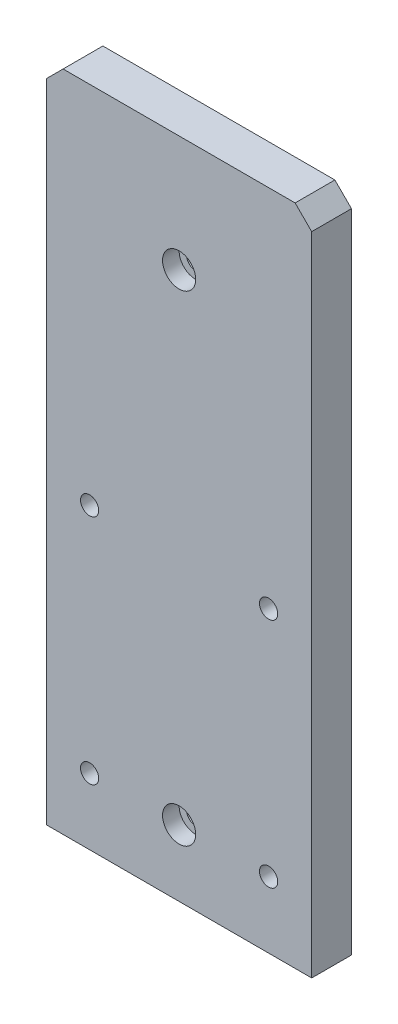
ISO-10303-21;
HEADER;
FILE_DESCRIPTION(('STEP AP214'),'2;1');
FILE_NAME('part.step','',(''),(''),'','','');
FILE_SCHEMA(('AUTOMOTIVE_DESIGN { 1 0 10303 214 1 1 1 1 }'));
ENDSEC;
DATA;
#1=APPLICATION_CONTEXT('core data for automotive mechanical design processes');
#2=APPLICATION_PROTOCOL_DEFINITION('international standard','automotive_design',2000,#1);
#3=PRODUCT_CONTEXT('',#1,'mechanical');
#4=PRODUCT('Part','Part','',(#3));
#5=PRODUCT_RELATED_PRODUCT_CATEGORY('part','',(#4));
#6=PRODUCT_DEFINITION_FORMATION('','',#4);
#7=PRODUCT_DEFINITION_CONTEXT('part definition',#1,'design');
#8=PRODUCT_DEFINITION('design','',#6,#7);
#9=PRODUCT_DEFINITION_SHAPE('','',#8);
#10=(LENGTH_UNIT() NAMED_UNIT(*) SI_UNIT(.MILLI.,.METRE.));
#11=(NAMED_UNIT(*) PLANE_ANGLE_UNIT() SI_UNIT($,.RADIAN.));
#12=(NAMED_UNIT(*) SI_UNIT($,.STERADIAN.) SOLID_ANGLE_UNIT());
#13=UNCERTAINTY_MEASURE_WITH_UNIT(LENGTH_MEASURE(1.E-05),#10,'distance_accuracy_value','');
#14=(GEOMETRIC_REPRESENTATION_CONTEXT(3) GLOBAL_UNCERTAINTY_ASSIGNED_CONTEXT((#13)) GLOBAL_UNIT_ASSIGNED_CONTEXT((#10,
#11,#12)) REPRESENTATION_CONTEXT('',''));
#15=CARTESIAN_POINT('',(0.,0.,0.));
#16=DIRECTION('',(0.,0.,1.));
#17=DIRECTION('',(1.,0.,0.));
#18=AXIS2_PLACEMENT_3D('',#15,#16,#17);
#19=CARTESIAN_POINT('',(-40.,0.,12.));
#20=DIRECTION('',(0.,1.,0.));
#21=DIRECTION('',(-1.,0.,0.));
#22=AXIS2_PLACEMENT_3D('',#19,#20,#21);
#23=PLANE('',#22);
#24=CARTESIAN_POINT('',(-25.,0.,6.));
#25=DIRECTION('',(0.,-1.,0.));
#26=DIRECTION('',(0.,0.,-1.));
#27=AXIS2_PLACEMENT_3D('',#24,#25,#26);
#28=CIRCLE('',#27,2.1);
#29=CARTESIAN_POINT('',(-25.,0.,3.9));
#30=VERTEX_POINT('',#29);
#31=EDGE_CURVE('E542',#30,#30,#28,.T.);
#32=ORIENTED_EDGE('',*,*,#31,.F.);
#33=EDGE_LOOP('',(#32));
#34=FACE_BOUND('',#33,.T.);
#35=CARTESIAN_POINT('',(25.,0.,6.));
#36=DIRECTION('',(0.,-1.,0.));
#37=DIRECTION('',(0.,0.,-1.));
#38=AXIS2_PLACEMENT_3D('',#35,#36,#37);
#39=CIRCLE('',#38,2.1);
#40=CARTESIAN_POINT('',(25.,0.,3.9));
#41=VERTEX_POINT('',#40);
#42=EDGE_CURVE('E550',#41,#41,#39,.T.);
#43=ORIENTED_EDGE('',*,*,#42,.F.);
#44=EDGE_LOOP('',(#43));
#45=FACE_BOUND('',#44,.T.);
#46=DIRECTION('',(1.,0.,0.));
#47=VECTOR('',#46,1.);
#48=CARTESIAN_POINT('',(-40.,0.,0.));
#49=LINE('',#48,#47);
#50=CARTESIAN_POINT('',(-40.,0.,0.));
#51=VERTEX_POINT('',#50);
#52=CARTESIAN_POINT('',(40.,0.,0.));
#53=VERTEX_POINT('',#52);
#54=EDGE_CURVE('E138',#51,#53,#49,.T.);
#55=ORIENTED_EDGE('',*,*,#54,.T.);
#56=DIRECTION('',(0.,0.,-1.));
#57=VECTOR('',#56,1.);
#58=CARTESIAN_POINT('',(40.,0.,12.));
#59=LINE('',#58,#57);
#60=CARTESIAN_POINT('',(40.,0.,12.));
#61=VERTEX_POINT('',#60);
#62=EDGE_CURVE('E56',#61,#53,#59,.T.);
#63=ORIENTED_EDGE('',*,*,#62,.F.);
#64=DIRECTION('',(1.,0.,0.));
#65=VECTOR('',#64,1.);
#66=CARTESIAN_POINT('',(-40.,0.,12.));
#67=LINE('',#66,#65);
#68=CARTESIAN_POINT('',(-40.,0.,12.));
#69=VERTEX_POINT('',#68);
#70=EDGE_CURVE('E102',#69,#61,#67,.T.);
#71=ORIENTED_EDGE('',*,*,#70,.F.);
#72=DIRECTION('',(0.,0.,-1.));
#73=VECTOR('',#72,1.);
#74=CARTESIAN_POINT('',(-40.,0.,12.));
#75=LINE('',#74,#73);
#76=EDGE_CURVE('E11',#69,#51,#75,.T.);
#77=ORIENTED_EDGE('',*,*,#76,.T.);
#78=EDGE_LOOP('',(#55,#63,#71,#77));
#79=FACE_BOUND('',#78,.T.);
#80=CARTESIAN_POINT('',(33.,0.,6.));
#81=DIRECTION('',(0.,1.,0.));
#82=DIRECTION('',(0.,0.,1.));
#83=AXIS2_PLACEMENT_3D('',#80,#81,#82);
#84=CIRCLE('',#83,2.);
#85=CARTESIAN_POINT('',(33.,0.,8.));
#86=VERTEX_POINT('',#85);
#87=EDGE_CURVE('E536',#86,#86,#84,.T.);
#88=ORIENTED_EDGE('',*,*,#87,.T.);
#89=EDGE_LOOP('',(#88));
#90=FACE_BOUND('',#89,.T.);
#91=CARTESIAN_POINT('',(-33.,0.,6.));
#92=DIRECTION('',(0.,1.,0.));
#93=DIRECTION('',(0.,0.,1.));
#94=AXIS2_PLACEMENT_3D('',#91,#92,#93);
#95=CIRCLE('',#94,2.);
#96=CARTESIAN_POINT('',(-33.,0.,8.));
#97=VERTEX_POINT('',#96);
#98=EDGE_CURVE('E532',#97,#97,#95,.T.);
#99=ORIENTED_EDGE('',*,*,#98,.T.);
#100=EDGE_LOOP('',(#99));
#101=FACE_BOUND('',#100,.T.);
#102=ADVANCED_FACE('F47',(#34,#45,#79,#90,#101),#23,.F.);
#103=CARTESIAN_POINT('',(-40.,0.,12.));
#104=DIRECTION('',(1.,0.,0.));
#105=DIRECTION('',(0.,1.,0.));
#106=AXIS2_PLACEMENT_3D('',#103,#104,#105);
#107=PLANE('',#106);
#108=DIRECTION('',(0.,-1.,0.));
#109=VECTOR('',#108,1.);
#110=CARTESIAN_POINT('',(-40.,0.,0.));
#111=LINE('',#110,#109);
#112=CARTESIAN_POINT('',(-40.,195.,0.));
#113=VERTEX_POINT('',#112);
#114=EDGE_CURVE('E135',#113,#51,#111,.T.);
#115=ORIENTED_EDGE('',*,*,#114,.T.);
#116=ORIENTED_EDGE('',*,*,#76,.F.);
#117=DIRECTION('',(0.,-1.,0.));
#118=VECTOR('',#117,1.);
#119=CARTESIAN_POINT('',(-40.,0.,12.));
#120=LINE('',#119,#118);
#121=CARTESIAN_POINT('',(-40.,195.,12.));
#122=VERTEX_POINT('',#121);
#123=EDGE_CURVE('E146',#122,#69,#120,.T.);
#124=ORIENTED_EDGE('',*,*,#123,.F.);
#125=DIRECTION('',(0.,0.,-1.));
#126=VECTOR('',#125,1.);
#127=CARTESIAN_POINT('',(-40.,195.,12.));
#128=LINE('',#127,#126);
#129=EDGE_CURVE('E131',#122,#113,#128,.T.);
#130=ORIENTED_EDGE('',*,*,#129,.T.);
#131=EDGE_LOOP('',(#115,#116,#124,#130));
#132=FACE_BOUND('',#131,.T.);
#133=ADVANCED_FACE('F49',(#132),#107,.F.);
#134=CARTESIAN_POINT('',(40.,0.,12.));
#135=DIRECTION('',(-1.,0.,0.));
#136=DIRECTION('',(0.,-1.,0.));
#137=AXIS2_PLACEMENT_3D('',#134,#135,#136);
#138=PLANE('',#137);
#139=DIRECTION('',(0.,1.,0.));
#140=VECTOR('',#139,1.);
#141=CARTESIAN_POINT('',(40.,0.,0.));
#142=LINE('',#141,#140);
#143=CARTESIAN_POINT('',(40.,195.,0.));
#144=VERTEX_POINT('',#143);
#145=EDGE_CURVE('E141',#53,#144,#142,.T.);
#146=ORIENTED_EDGE('',*,*,#145,.T.);
#147=DIRECTION('',(0.,0.,-1.));
#148=VECTOR('',#147,1.);
#149=CARTESIAN_POINT('',(40.,195.,12.));
#150=LINE('',#149,#148);
#151=CARTESIAN_POINT('',(40.,195.,12.));
#152=VERTEX_POINT('',#151);
#153=EDGE_CURVE('E126',#152,#144,#150,.T.);
#154=ORIENTED_EDGE('',*,*,#153,.F.);
#155=DIRECTION('',(0.,1.,0.));
#156=VECTOR('',#155,1.);
#157=CARTESIAN_POINT('',(40.,0.,12.));
#158=LINE('',#157,#156);
#159=EDGE_CURVE('E117',#61,#152,#158,.T.);
#160=ORIENTED_EDGE('',*,*,#159,.F.);
#161=ORIENTED_EDGE('',*,*,#62,.T.);
#162=EDGE_LOOP('',(#146,#154,#160,#161));
#163=FACE_BOUND('',#162,.T.);
#164=ADVANCED_FACE('F152',(#163),#138,.F.);
#165=CARTESIAN_POINT('',(35.,200.,12.));
#166=DIRECTION('',(-0.707106781186548,-0.707106781186547,0.));
#167=DIRECTION('',(0.707106781186547,-0.707106781186548,0.));
#168=AXIS2_PLACEMENT_3D('',#165,#166,#167);
#169=PLANE('',#168);
#170=DIRECTION('',(-0.707106781186547,0.707106781186548,0.));
#171=VECTOR('',#170,1.);
#172=CARTESIAN_POINT('',(35.,200.,0.));
#173=LINE('',#172,#171);
#174=CARTESIAN_POINT('',(35.,200.,0.));
#175=VERTEX_POINT('',#174);
#176=EDGE_CURVE('E125',#144,#175,#173,.T.);
#177=ORIENTED_EDGE('',*,*,#176,.T.);
#178=DIRECTION('',(0.,0.,-1.));
#179=VECTOR('',#178,1.);
#180=CARTESIAN_POINT('',(35.,200.,12.));
#181=LINE('',#180,#179);
#182=CARTESIAN_POINT('',(35.,200.,12.));
#183=VERTEX_POINT('',#182);
#184=EDGE_CURVE('E122',#183,#175,#181,.T.);
#185=ORIENTED_EDGE('',*,*,#184,.F.);
#186=DIRECTION('',(-0.707106781186547,0.707106781186548,0.));
#187=VECTOR('',#186,1.);
#188=CARTESIAN_POINT('',(35.,200.,12.));
#189=LINE('',#188,#187);
#190=EDGE_CURVE('E111',#152,#183,#189,.T.);
#191=ORIENTED_EDGE('',*,*,#190,.F.);
#192=ORIENTED_EDGE('',*,*,#153,.T.);
#193=EDGE_LOOP('',(#177,#185,#191,#192));
#194=FACE_BOUND('',#193,.T.);
#195=ADVANCED_FACE('F123',(#194),#169,.F.);
#196=CARTESIAN_POINT('',(-35.,200.,12.));
#197=DIRECTION('',(0.,-1.,0.));
#198=DIRECTION('',(0.,0.,-1.));
#199=AXIS2_PLACEMENT_3D('',#196,#197,#198);
#200=PLANE('',#199);
#201=DIRECTION('',(-1.,0.,0.));
#202=VECTOR('',#201,1.);
#203=CARTESIAN_POINT('',(-35.,200.,0.));
#204=LINE('',#203,#202);
#205=CARTESIAN_POINT('',(-35.,200.,0.));
#206=VERTEX_POINT('',#205);
#207=EDGE_CURVE('E88',#175,#206,#204,.T.);
#208=ORIENTED_EDGE('',*,*,#207,.T.);
#209=DIRECTION('',(0.,0.,-1.));
#210=VECTOR('',#209,1.);
#211=CARTESIAN_POINT('',(-35.,200.,12.));
#212=LINE('',#211,#210);
#213=CARTESIAN_POINT('',(-35.,200.,12.));
#214=VERTEX_POINT('',#213);
#215=EDGE_CURVE('E127',#214,#206,#212,.T.);
#216=ORIENTED_EDGE('',*,*,#215,.F.);
#217=DIRECTION('',(-1.,0.,0.));
#218=VECTOR('',#217,1.);
#219=CARTESIAN_POINT('',(-35.,200.,12.));
#220=LINE('',#219,#218);
#221=EDGE_CURVE('E115',#183,#214,#220,.T.);
#222=ORIENTED_EDGE('',*,*,#221,.F.);
#223=ORIENTED_EDGE('',*,*,#184,.T.);
#224=EDGE_LOOP('',(#208,#216,#222,#223));
#225=FACE_BOUND('',#224,.T.);
#226=ADVANCED_FACE('F129',(#225),#200,.F.);
#227=CARTESIAN_POINT('',(-35.,200.,12.));
#228=DIRECTION('',(0.707106781186548,-0.707106781186547,0.));
#229=DIRECTION('',(0.707106781186547,0.707106781186548,0.));
#230=AXIS2_PLACEMENT_3D('',#227,#228,#229);
#231=PLANE('',#230);
#232=DIRECTION('',(-0.707106781186547,-0.707106781186548,0.));
#233=VECTOR('',#232,1.);
#234=CARTESIAN_POINT('',(-35.,200.,0.));
#235=LINE('',#234,#233);
#236=EDGE_CURVE('E94',#206,#113,#235,.T.);
#237=ORIENTED_EDGE('',*,*,#236,.T.);
#238=ORIENTED_EDGE('',*,*,#129,.F.);
#239=DIRECTION('',(-0.707106781186547,-0.707106781186548,0.));
#240=VECTOR('',#239,1.);
#241=CARTESIAN_POINT('',(-35.,200.,12.));
#242=LINE('',#241,#240);
#243=EDGE_CURVE('E64',#214,#122,#242,.T.);
#244=ORIENTED_EDGE('',*,*,#243,.F.);
#245=ORIENTED_EDGE('',*,*,#215,.T.);
#246=EDGE_LOOP('',(#237,#238,#244,#245));
#247=FACE_BOUND('',#246,.T.);
#248=ADVANCED_FACE('F159',(#247),#231,.F.);
#249=CARTESIAN_POINT('',(-40.,200.,12.));
#250=DIRECTION('',(0.,0.,-1.));
#251=DIRECTION('',(-1.,0.,0.));
#252=AXIS2_PLACEMENT_3D('',#249,#250,#251);
#253=PLANE('',#252);
#254=CARTESIAN_POINT('',(-27.,20.,12.));
#255=DIRECTION('',(0.,0.,-1.));
#256=DIRECTION('',(-1.,0.,0.));
#257=AXIS2_PLACEMENT_3D('',#254,#255,#256);
#258=CIRCLE('',#257,2.75);
#259=CARTESIAN_POINT('',(-29.75,20.,12.));
#260=VERTEX_POINT('',#259);
#261=EDGE_CURVE('E493',#260,#260,#258,.T.);
#262=ORIENTED_EDGE('',*,*,#261,.T.);
#263=EDGE_LOOP('',(#262));
#264=FACE_BOUND('',#263,.T.);
#265=CARTESIAN_POINT('',(-27.,90.,12.));
#266=DIRECTION('',(0.,0.,-1.));
#267=DIRECTION('',(-1.,0.,0.));
#268=AXIS2_PLACEMENT_3D('',#265,#266,#267);
#269=CIRCLE('',#268,2.75);
#270=CARTESIAN_POINT('',(-29.75,90.,12.));
#271=VERTEX_POINT('',#270);
#272=EDGE_CURVE('E505',#271,#271,#269,.T.);
#273=ORIENTED_EDGE('',*,*,#272,.T.);
#274=EDGE_LOOP('',(#273));
#275=FACE_BOUND('',#274,.T.);
#276=CARTESIAN_POINT('',(27.,90.,12.));
#277=DIRECTION('',(0.,0.,-1.));
#278=DIRECTION('',(-1.,0.,0.));
#279=AXIS2_PLACEMENT_3D('',#276,#277,#278);
#280=CIRCLE('',#279,2.75);
#281=CARTESIAN_POINT('',(24.25,90.,12.));
#282=VERTEX_POINT('',#281);
#283=EDGE_CURVE('E517',#282,#282,#280,.T.);
#284=ORIENTED_EDGE('',*,*,#283,.T.);
#285=EDGE_LOOP('',(#284));
#286=FACE_BOUND('',#285,.T.);
#287=CARTESIAN_POINT('',(27.,20.,12.));
#288=DIRECTION('',(0.,0.,-1.));
#289=DIRECTION('',(-1.,0.,0.));
#290=AXIS2_PLACEMENT_3D('',#287,#288,#289);
#291=CIRCLE('',#290,2.75);
#292=CARTESIAN_POINT('',(24.25,20.,12.));
#293=VERTEX_POINT('',#292);
#294=EDGE_CURVE('E529',#293,#293,#291,.T.);
#295=ORIENTED_EDGE('',*,*,#294,.T.);
#296=EDGE_LOOP('',(#295));
#297=FACE_BOUND('',#296,.T.);
#298=CARTESIAN_POINT('',(0.,20.,12.));
#299=DIRECTION('',(0.,0.,1.));
#300=DIRECTION('',(1.,0.,0.));
#301=AXIS2_PLACEMENT_3D('',#298,#299,#300);
#302=CIRCLE('',#301,4.99999999999999);
#303=CARTESIAN_POINT('',(4.99999999999999,20.,12.));
#304=VERTEX_POINT('',#303);
#305=EDGE_CURVE('E556',#304,#304,#302,.T.);
#306=ORIENTED_EDGE('',*,*,#305,.F.);
#307=EDGE_LOOP('',(#306));
#308=FACE_BOUND('',#307,.T.);
#309=CARTESIAN_POINT('',(0.,165.,12.));
#310=DIRECTION('',(0.,0.,1.));
#311=DIRECTION('',(1.,0.,0.));
#312=AXIS2_PLACEMENT_3D('',#309,#310,#311);
#313=CIRCLE('',#312,4.99999999999999);
#314=CARTESIAN_POINT('',(4.99999999999999,165.,12.));
#315=VERTEX_POINT('',#314);
#316=EDGE_CURVE('E568',#315,#315,#313,.T.);
#317=ORIENTED_EDGE('',*,*,#316,.F.);
#318=EDGE_LOOP('',(#317));
#319=FACE_BOUND('',#318,.T.);
#320=ORIENTED_EDGE('',*,*,#123,.T.);
#321=ORIENTED_EDGE('',*,*,#70,.T.);
#322=ORIENTED_EDGE('',*,*,#159,.T.);
#323=ORIENTED_EDGE('',*,*,#190,.T.);
#324=ORIENTED_EDGE('',*,*,#221,.T.);
#325=ORIENTED_EDGE('',*,*,#243,.T.);
#326=EDGE_LOOP('',(#320,#321,#322,#323,#324,#325));
#327=FACE_BOUND('',#326,.T.);
#328=ADVANCED_FACE('F113',(#264,#275,#286,#297,#308,#319,#327),#253,.F.);
#329=CARTESIAN_POINT('',(-40.,200.,0.));
#330=DIRECTION('',(0.,0.,-1.));
#331=DIRECTION('',(-1.,0.,0.));
#332=AXIS2_PLACEMENT_3D('',#329,#330,#331);
#333=PLANE('',#332);
#334=CARTESIAN_POINT('',(-27.,20.,0.));
#335=DIRECTION('',(0.,0.,-1.));
#336=DIRECTION('',(-1.,0.,0.));
#337=AXIS2_PLACEMENT_3D('',#334,#335,#336);
#338=CIRCLE('',#337,4.99999999999999);
#339=CARTESIAN_POINT('',(-32.,20.,0.));
#340=VERTEX_POINT('',#339);
#341=EDGE_CURVE('E486',#340,#340,#338,.T.);
#342=ORIENTED_EDGE('',*,*,#341,.F.);
#343=EDGE_LOOP('',(#342));
#344=FACE_BOUND('',#343,.T.);
#345=CARTESIAN_POINT('',(-27.,90.,0.));
#346=DIRECTION('',(0.,0.,-1.));
#347=DIRECTION('',(-1.,0.,0.));
#348=AXIS2_PLACEMENT_3D('',#345,#346,#347);
#349=CIRCLE('',#348,4.99999999999999);
#350=CARTESIAN_POINT('',(-32.,90.,0.));
#351=VERTEX_POINT('',#350);
#352=EDGE_CURVE('E496',#351,#351,#349,.T.);
#353=ORIENTED_EDGE('',*,*,#352,.F.);
#354=EDGE_LOOP('',(#353));
#355=FACE_BOUND('',#354,.T.);
#356=CARTESIAN_POINT('',(27.,90.,0.));
#357=DIRECTION('',(0.,0.,-1.));
#358=DIRECTION('',(-1.,0.,0.));
#359=AXIS2_PLACEMENT_3D('',#356,#357,#358);
#360=CIRCLE('',#359,5.);
#361=CARTESIAN_POINT('',(22.,90.,0.));
#362=VERTEX_POINT('',#361);
#363=EDGE_CURVE('E508',#362,#362,#360,.T.);
#364=ORIENTED_EDGE('',*,*,#363,.F.);
#365=EDGE_LOOP('',(#364));
#366=FACE_BOUND('',#365,.T.);
#367=CARTESIAN_POINT('',(27.,20.,0.));
#368=DIRECTION('',(0.,0.,-1.));
#369=DIRECTION('',(-1.,0.,0.));
#370=AXIS2_PLACEMENT_3D('',#367,#368,#369);
#371=CIRCLE('',#370,5.);
#372=CARTESIAN_POINT('',(22.,20.,0.));
#373=VERTEX_POINT('',#372);
#374=EDGE_CURVE('E520',#373,#373,#371,.T.);
#375=ORIENTED_EDGE('',*,*,#374,.F.);
#376=EDGE_LOOP('',(#375));
#377=FACE_BOUND('',#376,.T.);
#378=CARTESIAN_POINT('',(0.,20.,0.));
#379=DIRECTION('',(0.,0.,1.));
#380=DIRECTION('',(1.,0.,0.));
#381=AXIS2_PLACEMENT_3D('',#378,#379,#380);
#382=CIRCLE('',#381,2.75000000000001);
#383=CARTESIAN_POINT('',(2.75000000000001,20.,0.));
#384=VERTEX_POINT('',#383);
#385=EDGE_CURVE('E565',#384,#384,#382,.T.);
#386=ORIENTED_EDGE('',*,*,#385,.T.);
#387=EDGE_LOOP('',(#386));
#388=FACE_BOUND('',#387,.T.);
#389=CARTESIAN_POINT('',(0.,165.,0.));
#390=DIRECTION('',(0.,0.,1.));
#391=DIRECTION('',(1.,0.,0.));
#392=AXIS2_PLACEMENT_3D('',#389,#390,#391);
#393=CIRCLE('',#392,2.75000000000001);
#394=CARTESIAN_POINT('',(2.75000000000001,165.,0.));
#395=VERTEX_POINT('',#394);
#396=EDGE_CURVE('E139',#395,#395,#393,.T.);
#397=ORIENTED_EDGE('',*,*,#396,.T.);
#398=EDGE_LOOP('',(#397));
#399=FACE_BOUND('',#398,.T.);
#400=ORIENTED_EDGE('',*,*,#114,.F.);
#401=ORIENTED_EDGE('',*,*,#236,.F.);
#402=ORIENTED_EDGE('',*,*,#207,.F.);
#403=ORIENTED_EDGE('',*,*,#176,.F.);
#404=ORIENTED_EDGE('',*,*,#145,.F.);
#405=ORIENTED_EDGE('',*,*,#54,.F.);
#406=EDGE_LOOP('',(#400,#401,#402,#403,#404,#405));
#407=FACE_BOUND('',#406,.T.);
#408=ADVANCED_FACE('F155',(#344,#355,#366,#377,#388,#399,#407),#333,.T.);
#409=CARTESIAN_POINT('',(0.,165.,12.));
#410=DIRECTION('',(0.,0.,1.));
#411=DIRECTION('',(1.,0.,0.));
#412=AXIS2_PLACEMENT_3D('',#409,#410,#411);
#413=CYLINDRICAL_SURFACE('',#412,2.75000000000001);
#414=ORIENTED_EDGE('',*,*,#396,.F.);
#415=EDGE_LOOP('',(#414));
#416=FACE_BOUND('',#415,.T.);
#417=CARTESIAN_POINT('',(0.,165.,7.));
#418=DIRECTION('',(0.,0.,1.));
#419=DIRECTION('',(1.,0.,0.));
#420=AXIS2_PLACEMENT_3D('',#417,#418,#419);
#421=CIRCLE('',#420,2.75000000000001);
#422=CARTESIAN_POINT('',(2.75000000000001,165.,7.));
#423=VERTEX_POINT('',#422);
#424=EDGE_CURVE('E574',#423,#423,#421,.T.);
#425=ORIENTED_EDGE('',*,*,#424,.T.);
#426=EDGE_LOOP('',(#425));
#427=FACE_BOUND('',#426,.T.);
#428=ADVANCED_FACE('F214',(#416,#427),#413,.F.);
#429=CARTESIAN_POINT('',(2.75000000000001,165.,7.));
#430=DIRECTION('',(0.,0.,-1.));
#431=DIRECTION('',(-1.,0.,0.));
#432=AXIS2_PLACEMENT_3D('',#429,#430,#431);
#433=PLANE('',#432);
#434=ORIENTED_EDGE('',*,*,#424,.F.);
#435=EDGE_LOOP('',(#434));
#436=FACE_BOUND('',#435,.T.);
#437=CARTESIAN_POINT('',(0.,165.,7.));
#438=DIRECTION('',(0.,0.,1.));
#439=DIRECTION('',(1.,0.,0.));
#440=AXIS2_PLACEMENT_3D('',#437,#438,#439);
#441=CIRCLE('',#440,4.99999999999999);
#442=CARTESIAN_POINT('',(4.99999999999999,165.,7.));
#443=VERTEX_POINT('',#442);
#444=EDGE_CURVE('E571',#443,#443,#441,.T.);
#445=ORIENTED_EDGE('',*,*,#444,.T.);
#446=EDGE_LOOP('',(#445));
#447=FACE_BOUND('',#446,.T.);
#448=ADVANCED_FACE('F223',(#436,#447),#433,.F.);
#449=CARTESIAN_POINT('',(0.,165.,12.));
#450=DIRECTION('',(0.,0.,1.));
#451=DIRECTION('',(1.,0.,0.));
#452=AXIS2_PLACEMENT_3D('',#449,#450,#451);
#453=CYLINDRICAL_SURFACE('',#452,4.99999999999999);
#454=ORIENTED_EDGE('',*,*,#444,.F.);
#455=EDGE_LOOP('',(#454));
#456=FACE_BOUND('',#455,.T.);
#457=ORIENTED_EDGE('',*,*,#316,.T.);
#458=EDGE_LOOP('',(#457));
#459=FACE_BOUND('',#458,.T.);
#460=ADVANCED_FACE('F233',(#456,#459),#453,.F.);
#461=CARTESIAN_POINT('',(0.,20.,12.));
#462=DIRECTION('',(0.,0.,1.));
#463=DIRECTION('',(1.,0.,0.));
#464=AXIS2_PLACEMENT_3D('',#461,#462,#463);
#465=CYLINDRICAL_SURFACE('',#464,2.75000000000001);
#466=ORIENTED_EDGE('',*,*,#385,.F.);
#467=EDGE_LOOP('',(#466));
#468=FACE_BOUND('',#467,.T.);
#469=CARTESIAN_POINT('',(0.,20.,7.));
#470=DIRECTION('',(0.,0.,1.));
#471=DIRECTION('',(1.,0.,0.));
#472=AXIS2_PLACEMENT_3D('',#469,#470,#471);
#473=CIRCLE('',#472,2.75000000000001);
#474=CARTESIAN_POINT('',(2.75000000000001,20.,7.));
#475=VERTEX_POINT('',#474);
#476=EDGE_CURVE('E562',#475,#475,#473,.T.);
#477=ORIENTED_EDGE('',*,*,#476,.T.);
#478=EDGE_LOOP('',(#477));
#479=FACE_BOUND('',#478,.T.);
#480=ADVANCED_FACE('F243',(#468,#479),#465,.F.);
#481=CARTESIAN_POINT('',(2.75000000000001,20.,7.));
#482=DIRECTION('',(0.,0.,-1.));
#483=DIRECTION('',(-1.,0.,0.));
#484=AXIS2_PLACEMENT_3D('',#481,#482,#483);
#485=PLANE('',#484);
#486=ORIENTED_EDGE('',*,*,#476,.F.);
#487=EDGE_LOOP('',(#486));
#488=FACE_BOUND('',#487,.T.);
#489=CARTESIAN_POINT('',(0.,20.,7.));
#490=DIRECTION('',(0.,0.,1.));
#491=DIRECTION('',(1.,0.,0.));
#492=AXIS2_PLACEMENT_3D('',#489,#490,#491);
#493=CIRCLE('',#492,4.99999999999999);
#494=CARTESIAN_POINT('',(4.99999999999999,20.,7.));
#495=VERTEX_POINT('',#494);
#496=EDGE_CURVE('E559',#495,#495,#493,.T.);
#497=ORIENTED_EDGE('',*,*,#496,.T.);
#498=EDGE_LOOP('',(#497));
#499=FACE_BOUND('',#498,.T.);
#500=ADVANCED_FACE('F253',(#488,#499),#485,.F.);
#501=CARTESIAN_POINT('',(0.,20.,12.));
#502=DIRECTION('',(0.,0.,1.));
#503=DIRECTION('',(1.,0.,0.));
#504=AXIS2_PLACEMENT_3D('',#501,#502,#503);
#505=CYLINDRICAL_SURFACE('',#504,4.99999999999999);
#506=ORIENTED_EDGE('',*,*,#496,.F.);
#507=EDGE_LOOP('',(#506));
#508=FACE_BOUND('',#507,.T.);
#509=ORIENTED_EDGE('',*,*,#305,.T.);
#510=EDGE_LOOP('',(#509));
#511=FACE_BOUND('',#510,.T.);
#512=ADVANCED_FACE('F263',(#508,#511),#505,.F.);
#513=CARTESIAN_POINT('',(25.,14.,6.));
#514=DIRECTION('',(0.,-1.,0.));
#515=DIRECTION('',(0.,0.,-1.));
#516=AXIS2_PLACEMENT_3D('',#513,#514,#515);
#517=CONICAL_SURFACE('',#516,2.1,1.02974425867665);
#518=CARTESIAN_POINT('',(25.,15.2618072999579,6.));
#519=VERTEX_POINT('',#518);
#520=VERTEX_LOOP('',#519);
#521=FACE_BOUND('',#520,.T.);
#522=CARTESIAN_POINT('',(25.,14.,6.));
#523=DIRECTION('',(0.,-1.,0.));
#524=DIRECTION('',(0.,0.,-1.));
#525=AXIS2_PLACEMENT_3D('',#522,#523,#524);
#526=CIRCLE('',#525,2.1);
#527=CARTESIAN_POINT('',(25.,14.,3.9));
#528=VERTEX_POINT('',#527);
#529=EDGE_CURVE('E553',#528,#528,#526,.T.);
#530=ORIENTED_EDGE('',*,*,#529,.T.);
#531=EDGE_LOOP('',(#530));
#532=FACE_BOUND('',#531,.T.);
#533=ADVANCED_FACE('F273',(#521,#532),#517,.F.);
#534=CARTESIAN_POINT('',(25.,0.,6.));
#535=DIRECTION('',(0.,-1.,0.));
#536=DIRECTION('',(0.,0.,-1.));
#537=AXIS2_PLACEMENT_3D('',#534,#535,#536);
#538=CYLINDRICAL_SURFACE('',#537,2.1);
#539=ORIENTED_EDGE('',*,*,#529,.F.);
#540=EDGE_LOOP('',(#539));
#541=FACE_BOUND('',#540,.T.);
#542=ORIENTED_EDGE('',*,*,#42,.T.);
#543=EDGE_LOOP('',(#542));
#544=FACE_BOUND('',#543,.T.);
#545=ADVANCED_FACE('F283',(#541,#544),#538,.F.);
#546=CARTESIAN_POINT('',(-25.,14.,6.));
#547=DIRECTION('',(0.,-1.,0.));
#548=DIRECTION('',(0.,0.,-1.));
#549=AXIS2_PLACEMENT_3D('',#546,#547,#548);
#550=CONICAL_SURFACE('',#549,2.1,1.02974425867665);
#551=CARTESIAN_POINT('',(-25.,15.2618072999579,6.));
#552=VERTEX_POINT('',#551);
#553=VERTEX_LOOP('',#552);
#554=FACE_BOUND('',#553,.T.);
#555=CARTESIAN_POINT('',(-25.,14.,6.));
#556=DIRECTION('',(0.,-1.,0.));
#557=DIRECTION('',(0.,0.,-1.));
#558=AXIS2_PLACEMENT_3D('',#555,#556,#557);
#559=CIRCLE('',#558,2.1);
#560=CARTESIAN_POINT('',(-25.,14.,3.9));
#561=VERTEX_POINT('',#560);
#562=EDGE_CURVE('E547',#561,#561,#559,.T.);
#563=ORIENTED_EDGE('',*,*,#562,.T.);
#564=EDGE_LOOP('',(#563));
#565=FACE_BOUND('',#564,.T.);
#566=ADVANCED_FACE('F294',(#554,#565),#550,.F.);
#567=CARTESIAN_POINT('',(-25.,0.,6.));
#568=DIRECTION('',(0.,-1.,0.));
#569=DIRECTION('',(0.,0.,-1.));
#570=AXIS2_PLACEMENT_3D('',#567,#568,#569);
#571=CYLINDRICAL_SURFACE('',#570,2.1);
#572=ORIENTED_EDGE('',*,*,#562,.F.);
#573=EDGE_LOOP('',(#572));
#574=FACE_BOUND('',#573,.T.);
#575=ORIENTED_EDGE('',*,*,#31,.T.);
#576=EDGE_LOOP('',(#575));
#577=FACE_BOUND('',#576,.T.);
#578=ADVANCED_FACE('F305',(#574,#577),#571,.F.);
#579=CARTESIAN_POINT('',(33.,8.,6.));
#580=DIRECTION('',(0.,-1.,0.));
#581=DIRECTION('',(0.,0.,-1.));
#582=AXIS2_PLACEMENT_3D('',#579,#580,#581);
#583=CYLINDRICAL_SURFACE('',#582,2.);
#584=CARTESIAN_POINT('',(33.,8.,6.));
#585=DIRECTION('',(0.,1.,0.));
#586=DIRECTION('',(0.,0.,1.));
#587=AXIS2_PLACEMENT_3D('',#584,#585,#586);
#588=CIRCLE('',#587,2.);
#589=CARTESIAN_POINT('',(33.,8.,8.));
#590=VERTEX_POINT('',#589);
#591=EDGE_CURVE('E539',#590,#590,#588,.T.);
#592=ORIENTED_EDGE('',*,*,#591,.T.);
#593=EDGE_LOOP('',(#592));
#594=FACE_BOUND('',#593,.T.);
#595=ORIENTED_EDGE('',*,*,#87,.F.);
#596=EDGE_LOOP('',(#595));
#597=FACE_BOUND('',#596,.T.);
#598=ADVANCED_FACE('F314',(#594,#597),#583,.F.);
#599=CARTESIAN_POINT('',(33.,8.,6.));
#600=DIRECTION('',(0.,1.,0.));
#601=DIRECTION('',(0.,0.,1.));
#602=AXIS2_PLACEMENT_3D('',#599,#600,#601);
#603=PLANE('',#602);
#604=ORIENTED_EDGE('',*,*,#591,.F.);
#605=EDGE_LOOP('',(#604));
#606=FACE_BOUND('',#605,.T.);
#607=ADVANCED_FACE('F329',(#606),#603,.F.);
#608=CARTESIAN_POINT('',(-33.,8.,6.));
#609=DIRECTION('',(0.,-1.,0.));
#610=DIRECTION('',(0.,0.,-1.));
#611=AXIS2_PLACEMENT_3D('',#608,#609,#610);
#612=CYLINDRICAL_SURFACE('',#611,2.);
#613=CARTESIAN_POINT('',(-33.,8.,6.));
#614=DIRECTION('',(0.,1.,0.));
#615=DIRECTION('',(0.,0.,1.));
#616=AXIS2_PLACEMENT_3D('',#613,#614,#615);
#617=CIRCLE('',#616,2.);
#618=CARTESIAN_POINT('',(-33.,8.,8.));
#619=VERTEX_POINT('',#618);
#620=EDGE_CURVE('E533',#619,#619,#617,.T.);
#621=ORIENTED_EDGE('',*,*,#620,.T.);
#622=EDGE_LOOP('',(#621));
#623=FACE_BOUND('',#622,.T.);
#624=ORIENTED_EDGE('',*,*,#98,.F.);
#625=EDGE_LOOP('',(#624));
#626=FACE_BOUND('',#625,.T.);
#627=ADVANCED_FACE('F339',(#623,#626),#612,.F.);
#628=CARTESIAN_POINT('',(-33.,8.,6.));
#629=DIRECTION('',(0.,1.,0.));
#630=DIRECTION('',(0.,0.,1.));
#631=AXIS2_PLACEMENT_3D('',#628,#629,#630);
#632=PLANE('',#631);
#633=ORIENTED_EDGE('',*,*,#620,.F.);
#634=EDGE_LOOP('',(#633));
#635=FACE_BOUND('',#634,.T.);
#636=ADVANCED_FACE('F349',(#635),#632,.F.);
#637=CARTESIAN_POINT('',(27.,20.,0.));
#638=DIRECTION('',(0.,0.,-1.));
#639=DIRECTION('',(-1.,0.,0.));
#640=AXIS2_PLACEMENT_3D('',#637,#638,#639);
#641=CYLINDRICAL_SURFACE('',#640,2.75);
#642=ORIENTED_EDGE('',*,*,#294,.F.);
#643=EDGE_LOOP('',(#642));
#644=FACE_BOUND('',#643,.T.);
#645=CARTESIAN_POINT('',(27.,20.,5.));
#646=DIRECTION('',(0.,0.,-1.));
#647=DIRECTION('',(-1.,0.,0.));
#648=AXIS2_PLACEMENT_3D('',#645,#646,#647);
#649=CIRCLE('',#648,2.75000000000001);
#650=CARTESIAN_POINT('',(24.25,20.,5.));
#651=VERTEX_POINT('',#650);
#652=EDGE_CURVE('E526',#651,#651,#649,.T.);
#653=ORIENTED_EDGE('',*,*,#652,.T.);
#654=EDGE_LOOP('',(#653));
#655=FACE_BOUND('',#654,.T.);
#656=ADVANCED_FACE('F358',(#644,#655),#641,.F.);
#657=CARTESIAN_POINT('',(29.75,20.,5.));
#658=DIRECTION('',(0.,0.,1.));
#659=DIRECTION('',(1.,0.,0.));
#660=AXIS2_PLACEMENT_3D('',#657,#658,#659);
#661=PLANE('',#660);
#662=ORIENTED_EDGE('',*,*,#652,.F.);
#663=EDGE_LOOP('',(#662));
#664=FACE_BOUND('',#663,.T.);
#665=CARTESIAN_POINT('',(27.,20.,5.));
#666=DIRECTION('',(0.,0.,-1.));
#667=DIRECTION('',(-1.,0.,0.));
#668=AXIS2_PLACEMENT_3D('',#665,#666,#667);
#669=CIRCLE('',#668,5.);
#670=CARTESIAN_POINT('',(22.,20.,5.));
#671=VERTEX_POINT('',#670);
#672=EDGE_CURVE('E523',#671,#671,#669,.T.);
#673=ORIENTED_EDGE('',*,*,#672,.T.);
#674=EDGE_LOOP('',(#673));
#675=FACE_BOUND('',#674,.T.);
#676=ADVANCED_FACE('F367',(#664,#675),#661,.F.);
#677=CARTESIAN_POINT('',(27.,20.,0.));
#678=DIRECTION('',(0.,0.,-1.));
#679=DIRECTION('',(-1.,0.,0.));
#680=AXIS2_PLACEMENT_3D('',#677,#678,#679);
#681=CYLINDRICAL_SURFACE('',#680,5.);
#682=ORIENTED_EDGE('',*,*,#672,.F.);
#683=EDGE_LOOP('',(#682));
#684=FACE_BOUND('',#683,.T.);
#685=ORIENTED_EDGE('',*,*,#374,.T.);
#686=EDGE_LOOP('',(#685));
#687=FACE_BOUND('',#686,.T.);
#688=ADVANCED_FACE('F377',(#684,#687),#681,.F.);
#689=CARTESIAN_POINT('',(27.,90.,0.));
#690=DIRECTION('',(0.,0.,-1.));
#691=DIRECTION('',(-1.,0.,0.));
#692=AXIS2_PLACEMENT_3D('',#689,#690,#691);
#693=CYLINDRICAL_SURFACE('',#692,2.75);
#694=ORIENTED_EDGE('',*,*,#283,.F.);
#695=EDGE_LOOP('',(#694));
#696=FACE_BOUND('',#695,.T.);
#697=CARTESIAN_POINT('',(27.,90.,5.));
#698=DIRECTION('',(0.,0.,-1.));
#699=DIRECTION('',(-1.,0.,0.));
#700=AXIS2_PLACEMENT_3D('',#697,#698,#699);
#701=CIRCLE('',#700,2.75000000000001);
#702=CARTESIAN_POINT('',(24.25,90.,5.));
#703=VERTEX_POINT('',#702);
#704=EDGE_CURVE('E514',#703,#703,#701,.T.);
#705=ORIENTED_EDGE('',*,*,#704,.T.);
#706=EDGE_LOOP('',(#705));
#707=FACE_BOUND('',#706,.T.);
#708=ADVANCED_FACE('F387',(#696,#707),#693,.F.);
#709=CARTESIAN_POINT('',(29.75,90.,5.));
#710=DIRECTION('',(0.,0.,1.));
#711=DIRECTION('',(1.,0.,0.));
#712=AXIS2_PLACEMENT_3D('',#709,#710,#711);
#713=PLANE('',#712);
#714=ORIENTED_EDGE('',*,*,#704,.F.);
#715=EDGE_LOOP('',(#714));
#716=FACE_BOUND('',#715,.T.);
#717=CARTESIAN_POINT('',(27.,90.,5.));
#718=DIRECTION('',(0.,0.,-1.));
#719=DIRECTION('',(-1.,0.,0.));
#720=AXIS2_PLACEMENT_3D('',#717,#718,#719);
#721=CIRCLE('',#720,5.);
#722=CARTESIAN_POINT('',(22.,90.,5.));
#723=VERTEX_POINT('',#722);
#724=EDGE_CURVE('E511',#723,#723,#721,.T.);
#725=ORIENTED_EDGE('',*,*,#724,.T.);
#726=EDGE_LOOP('',(#725));
#727=FACE_BOUND('',#726,.T.);
#728=ADVANCED_FACE('F397',(#716,#727),#713,.F.);
#729=CARTESIAN_POINT('',(27.,90.,0.));
#730=DIRECTION('',(0.,0.,-1.));
#731=DIRECTION('',(-1.,0.,0.));
#732=AXIS2_PLACEMENT_3D('',#729,#730,#731);
#733=CYLINDRICAL_SURFACE('',#732,5.);
#734=ORIENTED_EDGE('',*,*,#724,.F.);
#735=EDGE_LOOP('',(#734));
#736=FACE_BOUND('',#735,.T.);
#737=ORIENTED_EDGE('',*,*,#363,.T.);
#738=EDGE_LOOP('',(#737));
#739=FACE_BOUND('',#738,.T.);
#740=ADVANCED_FACE('F407',(#736,#739),#733,.F.);
#741=CARTESIAN_POINT('',(-27.,90.,0.));
#742=DIRECTION('',(0.,0.,-1.));
#743=DIRECTION('',(-1.,0.,0.));
#744=AXIS2_PLACEMENT_3D('',#741,#742,#743);
#745=CYLINDRICAL_SURFACE('',#744,2.75);
#746=ORIENTED_EDGE('',*,*,#272,.F.);
#747=EDGE_LOOP('',(#746));
#748=FACE_BOUND('',#747,.T.);
#749=CARTESIAN_POINT('',(-27.,90.,5.));
#750=DIRECTION('',(0.,0.,-1.));
#751=DIRECTION('',(-1.,0.,0.));
#752=AXIS2_PLACEMENT_3D('',#749,#750,#751);
#753=CIRCLE('',#752,2.75000000000001);
#754=CARTESIAN_POINT('',(-29.75,90.,5.));
#755=VERTEX_POINT('',#754);
#756=EDGE_CURVE('E502',#755,#755,#753,.T.);
#757=ORIENTED_EDGE('',*,*,#756,.T.);
#758=EDGE_LOOP('',(#757));
#759=FACE_BOUND('',#758,.T.);
#760=ADVANCED_FACE('F417',(#748,#759),#745,.F.);
#761=CARTESIAN_POINT('',(-24.25,90.,5.));
#762=DIRECTION('',(0.,0.,1.));
#763=DIRECTION('',(1.,0.,0.));
#764=AXIS2_PLACEMENT_3D('',#761,#762,#763);
#765=PLANE('',#764);
#766=ORIENTED_EDGE('',*,*,#756,.F.);
#767=EDGE_LOOP('',(#766));
#768=FACE_BOUND('',#767,.T.);
#769=CARTESIAN_POINT('',(-27.,90.,5.));
#770=DIRECTION('',(0.,0.,-1.));
#771=DIRECTION('',(-1.,0.,0.));
#772=AXIS2_PLACEMENT_3D('',#769,#770,#771);
#773=CIRCLE('',#772,4.99999999999999);
#774=CARTESIAN_POINT('',(-32.,90.,5.));
#775=VERTEX_POINT('',#774);
#776=EDGE_CURVE('E499',#775,#775,#773,.T.);
#777=ORIENTED_EDGE('',*,*,#776,.T.);
#778=EDGE_LOOP('',(#777));
#779=FACE_BOUND('',#778,.T.);
#780=ADVANCED_FACE('F427',(#768,#779),#765,.F.);
#781=CARTESIAN_POINT('',(-27.,90.,0.));
#782=DIRECTION('',(0.,0.,-1.));
#783=DIRECTION('',(-1.,0.,0.));
#784=AXIS2_PLACEMENT_3D('',#781,#782,#783);
#785=CYLINDRICAL_SURFACE('',#784,4.99999999999999);
#786=ORIENTED_EDGE('',*,*,#776,.F.);
#787=EDGE_LOOP('',(#786));
#788=FACE_BOUND('',#787,.T.);
#789=ORIENTED_EDGE('',*,*,#352,.T.);
#790=EDGE_LOOP('',(#789));
#791=FACE_BOUND('',#790,.T.);
#792=ADVANCED_FACE('F437',(#788,#791),#785,.F.);
#793=CARTESIAN_POINT('',(-27.,20.,0.));
#794=DIRECTION('',(0.,0.,-1.));
#795=DIRECTION('',(-1.,0.,0.));
#796=AXIS2_PLACEMENT_3D('',#793,#794,#795);
#797=CYLINDRICAL_SURFACE('',#796,2.75);
#798=ORIENTED_EDGE('',*,*,#261,.F.);
#799=EDGE_LOOP('',(#798));
#800=FACE_BOUND('',#799,.T.);
#801=CARTESIAN_POINT('',(-27.,20.,5.));
#802=DIRECTION('',(0.,0.,-1.));
#803=DIRECTION('',(-1.,0.,0.));
#804=AXIS2_PLACEMENT_3D('',#801,#802,#803);
#805=CIRCLE('',#804,2.75000000000001);
#806=CARTESIAN_POINT('',(-29.75,20.,5.));
#807=VERTEX_POINT('',#806);
#808=EDGE_CURVE('E488',#807,#807,#805,.T.);
#809=ORIENTED_EDGE('',*,*,#808,.T.);
#810=EDGE_LOOP('',(#809));
#811=FACE_BOUND('',#810,.T.);
#812=ADVANCED_FACE('F447',(#800,#811),#797,.F.);
#813=CARTESIAN_POINT('',(-24.25,20.,5.));
#814=DIRECTION('',(0.,0.,1.));
#815=DIRECTION('',(1.,0.,0.));
#816=AXIS2_PLACEMENT_3D('',#813,#814,#815);
#817=PLANE('',#816);
#818=ORIENTED_EDGE('',*,*,#808,.F.);
#819=EDGE_LOOP('',(#818));
#820=FACE_BOUND('',#819,.T.);
#821=CARTESIAN_POINT('',(-27.,20.,5.));
#822=DIRECTION('',(0.,0.,-1.));
#823=DIRECTION('',(-1.,0.,0.));
#824=AXIS2_PLACEMENT_3D('',#821,#822,#823);
#825=CIRCLE('',#824,4.99999999999999);
#826=CARTESIAN_POINT('',(-32.,20.,5.));
#827=VERTEX_POINT('',#826);
#828=EDGE_CURVE('E483',#827,#827,#825,.T.);
#829=ORIENTED_EDGE('',*,*,#828,.T.);
#830=EDGE_LOOP('',(#829));
#831=FACE_BOUND('',#830,.T.);
#832=ADVANCED_FACE('F457',(#820,#831),#817,.F.);
#833=CARTESIAN_POINT('',(-27.,20.,0.));
#834=DIRECTION('',(0.,0.,-1.));
#835=DIRECTION('',(-1.,0.,0.));
#836=AXIS2_PLACEMENT_3D('',#833,#834,#835);
#837=CYLINDRICAL_SURFACE('',#836,4.99999999999999);
#838=ORIENTED_EDGE('',*,*,#828,.F.);
#839=EDGE_LOOP('',(#838));
#840=FACE_BOUND('',#839,.T.);
#841=ORIENTED_EDGE('',*,*,#341,.T.);
#842=EDGE_LOOP('',(#841));
#843=FACE_BOUND('',#842,.T.);
#844=ADVANCED_FACE('F467',(#840,#843),#837,.F.);
#845=CLOSED_SHELL('',(#102,#133,#164,#195,#226,#248,#328,#408,#428,#448,#460,#480,#500,#512,
#533,#545,#566,#578,#598,#607,#627,#636,#656,#676,#688,#708,#728,#740,#760,#780,#792,#812,#832,#844));
#846=MANIFOLD_SOLID_BREP('B2',#845);
#847=ADVANCED_BREP_SHAPE_REPRESENTATION('',(#18,#846),#14);
#848=SHAPE_DEFINITION_REPRESENTATION(#9,#847);
ENDSEC;
END-ISO-10303-21;
